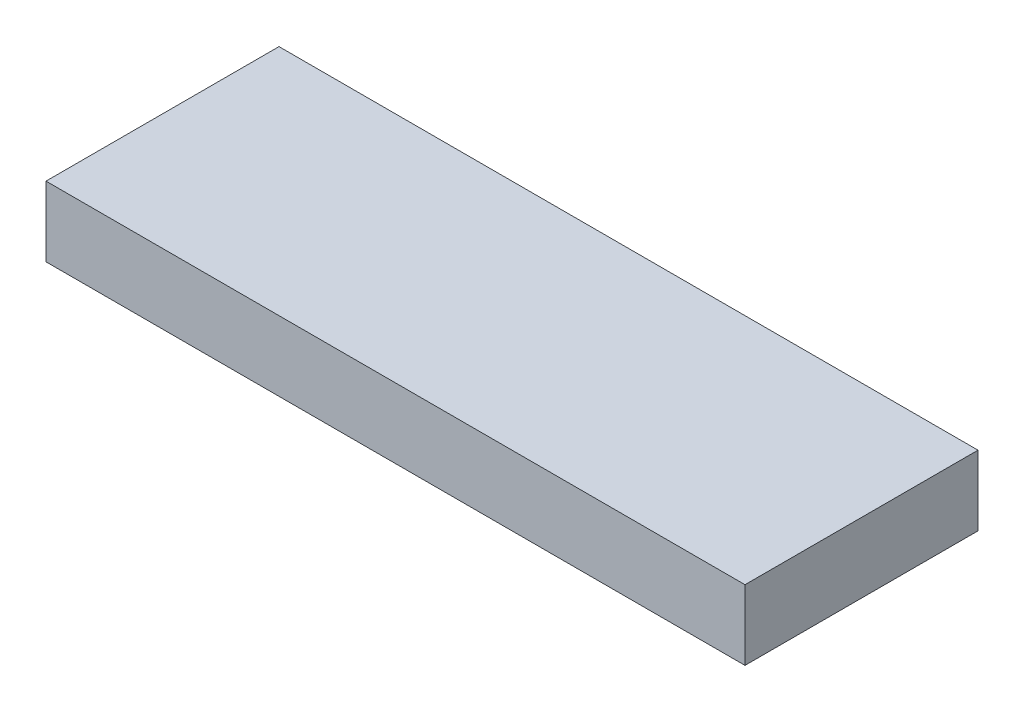
ISO-10303-21;
HEADER;
FILE_DESCRIPTION(('STEP AP214'),'2;1');
FILE_NAME('part.step','',(''),(''),'','','');
FILE_SCHEMA(('AUTOMOTIVE_DESIGN { 1 0 10303 214 1 1 1 1 }'));
ENDSEC;
DATA;
#1=APPLICATION_CONTEXT('core data for automotive mechanical design processes');
#2=APPLICATION_PROTOCOL_DEFINITION('international standard','automotive_design',2000,#1);
#3=PRODUCT_CONTEXT('',#1,'mechanical');
#4=PRODUCT('Part','Part','',(#3));
#5=PRODUCT_RELATED_PRODUCT_CATEGORY('part','',(#4));
#6=PRODUCT_DEFINITION_FORMATION('','',#4);
#7=PRODUCT_DEFINITION_CONTEXT('part definition',#1,'design');
#8=PRODUCT_DEFINITION('design','',#6,#7);
#9=PRODUCT_DEFINITION_SHAPE('','',#8);
#10=(LENGTH_UNIT() NAMED_UNIT(*) SI_UNIT(.MILLI.,.METRE.));
#11=(NAMED_UNIT(*) PLANE_ANGLE_UNIT() SI_UNIT($,.RADIAN.));
#12=(NAMED_UNIT(*) SI_UNIT($,.STERADIAN.) SOLID_ANGLE_UNIT());
#13=UNCERTAINTY_MEASURE_WITH_UNIT(LENGTH_MEASURE(1.E-05),#10,'distance_accuracy_value','');
#14=(GEOMETRIC_REPRESENTATION_CONTEXT(3) GLOBAL_UNCERTAINTY_ASSIGNED_CONTEXT((#13)) GLOBAL_UNIT_ASSIGNED_CONTEXT((#10,
#11,#12)) REPRESENTATION_CONTEXT('',''));
#15=CARTESIAN_POINT('',(0.,0.,0.));
#16=DIRECTION('',(0.,0.,1.));
#17=DIRECTION('',(1.,0.,0.));
#18=AXIS2_PLACEMENT_3D('',#15,#16,#17);
#19=CARTESIAN_POINT('',(-300.,46.99,23.));
#20=DIRECTION('',(0.,0.,1.));
#21=DIRECTION('',(1.,0.,0.));
#22=AXIS2_PLACEMENT_3D('',#19,#20,#21);
#23=PLANE('',#22);
#24=DIRECTION('',(0.,1.,0.));
#25=VECTOR('',#24,1.);
#26=CARTESIAN_POINT('',(-300.,0.,23.));
#27=LINE('',#26,#25);
#28=CARTESIAN_POINT('',(-300.,47.,23.));
#29=VERTEX_POINT('',#28);
#30=CARTESIAN_POINT('',(-300.,50.,23.));
#31=VERTEX_POINT('',#30);
#32=EDGE_CURVE('E58',#29,#31,#27,.T.);
#33=ORIENTED_EDGE('',*,*,#32,.F.);
#34=DIRECTION('',(1.,0.,0.));
#35=VECTOR('',#34,1.);
#36=CARTESIAN_POINT('',(300.,47.,22.9999999999999));
#37=LINE('',#36,#35);
#38=CARTESIAN_POINT('',(-270.,47.,23.));
#39=VERTEX_POINT('',#38);
#40=EDGE_CURVE('E88',#29,#39,#37,.T.);
#41=ORIENTED_EDGE('',*,*,#40,.T.);
#42=DIRECTION('',(0.,1.,0.));
#43=VECTOR('',#42,1.);
#44=CARTESIAN_POINT('',(-270.,46.99,23.));
#45=LINE('',#44,#43);
#46=CARTESIAN_POINT('',(-270.,50.,23.));
#47=VERTEX_POINT('',#46);
#48=EDGE_CURVE('E43',#39,#47,#45,.T.);
#49=ORIENTED_EDGE('',*,*,#48,.T.);
#50=DIRECTION('',(-1.,0.,0.));
#51=VECTOR('',#50,1.);
#52=CARTESIAN_POINT('',(-300.,50.,23.));
#53=LINE('',#52,#51);
#54=EDGE_CURVE('E103',#47,#31,#53,.T.);
#55=ORIENTED_EDGE('',*,*,#54,.T.);
#56=EDGE_LOOP('',(#33,#41,#49,#55));
#57=FACE_BOUND('',#56,.T.);
#58=ADVANCED_FACE('F35',(#57),#23,.T.);
#59=CARTESIAN_POINT('',(-300.,46.99,13.));
#60=DIRECTION('',(0.,0.,-1.));
#61=DIRECTION('',(-1.,0.,0.));
#62=AXIS2_PLACEMENT_3D('',#59,#60,#61);
#63=PLANE('',#62);
#64=DIRECTION('',(0.,1.,0.));
#65=VECTOR('',#64,1.);
#66=CARTESIAN_POINT('',(-270.,46.99,13.));
#67=LINE('',#66,#65);
#68=CARTESIAN_POINT('',(-270.,47.,13.));
#69=VERTEX_POINT('',#68);
#70=CARTESIAN_POINT('',(-270.,50.,13.));
#71=VERTEX_POINT('',#70);
#72=EDGE_CURVE('E11',#69,#71,#67,.T.);
#73=ORIENTED_EDGE('',*,*,#72,.F.);
#74=DIRECTION('',(-1.,0.,0.));
#75=VECTOR('',#74,1.);
#76=CARTESIAN_POINT('',(300.,47.,13.));
#77=LINE('',#76,#75);
#78=CARTESIAN_POINT('',(-300.,47.,13.));
#79=VERTEX_POINT('',#78);
#80=EDGE_CURVE('E89',#69,#79,#77,.T.);
#81=ORIENTED_EDGE('',*,*,#80,.T.);
#82=DIRECTION('',(0.,-1.,0.));
#83=VECTOR('',#82,1.);
#84=CARTESIAN_POINT('',(-300.,0.,13.));
#85=LINE('',#84,#83);
#86=CARTESIAN_POINT('',(-300.,50.,13.));
#87=VERTEX_POINT('',#86);
#88=EDGE_CURVE('E50',#87,#79,#85,.T.);
#89=ORIENTED_EDGE('',*,*,#88,.F.);
#90=DIRECTION('',(1.,0.,0.));
#91=VECTOR('',#90,1.);
#92=CARTESIAN_POINT('',(-300.,50.,13.));
#93=LINE('',#92,#91);
#94=EDGE_CURVE('E99',#87,#71,#93,.T.);
#95=ORIENTED_EDGE('',*,*,#94,.T.);
#96=EDGE_LOOP('',(#73,#81,#89,#95));
#97=FACE_BOUND('',#96,.T.);
#98=ADVANCED_FACE('F105',(#97),#63,.T.);
#99=CARTESIAN_POINT('',(-270.,46.99,13.));
#100=DIRECTION('',(1.,0.,0.));
#101=DIRECTION('',(0.,0.,-1.));
#102=AXIS2_PLACEMENT_3D('',#99,#100,#101);
#103=PLANE('',#102);
#104=ORIENTED_EDGE('',*,*,#48,.F.);
#105=DIRECTION('',(0.,0.,-1.));
#106=VECTOR('',#105,1.);
#107=CARTESIAN_POINT('',(-270.,47.,3.));
#108=LINE('',#107,#106);
#109=EDGE_CURVE('E79',#39,#69,#108,.T.);
#110=ORIENTED_EDGE('',*,*,#109,.T.);
#111=ORIENTED_EDGE('',*,*,#72,.T.);
#112=DIRECTION('',(0.,0.,1.));
#113=VECTOR('',#112,1.);
#114=CARTESIAN_POINT('',(-270.,50.,60.));
#115=LINE('',#114,#113);
#116=EDGE_CURVE('E81',#71,#47,#115,.T.);
#117=ORIENTED_EDGE('',*,*,#116,.T.);
#118=EDGE_LOOP('',(#104,#110,#111,#117));
#119=FACE_BOUND('',#118,.T.);
#120=ADVANCED_FACE('F78',(#119),#103,.T.);
#121=CARTESIAN_POINT('',(-300.,0.,0.));
#122=DIRECTION('',(-1.,0.,0.));
#123=DIRECTION('',(0.,0.,1.));
#124=AXIS2_PLACEMENT_3D('',#121,#122,#123);
#125=PLANE('',#124);
#126=DIRECTION('',(0.,0.,1.));
#127=VECTOR('',#126,1.);
#128=CARTESIAN_POINT('',(-300.,47.,3.));
#129=LINE('',#128,#127);
#130=EDGE_CURVE('E95',#79,#29,#129,.T.);
#131=ORIENTED_EDGE('',*,*,#130,.T.);
#132=ORIENTED_EDGE('',*,*,#32,.T.);
#133=DIRECTION('',(0.,0.,-1.));
#134=VECTOR('',#133,1.);
#135=CARTESIAN_POINT('',(-300.,50.,60.));
#136=LINE('',#135,#134);
#137=EDGE_CURVE('E83',#31,#87,#136,.T.);
#138=ORIENTED_EDGE('',*,*,#137,.T.);
#139=ORIENTED_EDGE('',*,*,#88,.T.);
#140=EDGE_LOOP('',(#131,#132,#138,#139));
#141=FACE_BOUND('',#140,.T.);
#142=ADVANCED_FACE('F37',(#141),#125,.T.);
#143=CARTESIAN_POINT('',(-300.,50.,60.));
#144=DIRECTION('',(0.,-1.,0.));
#145=DIRECTION('',(0.,0.,-1.));
#146=AXIS2_PLACEMENT_3D('',#143,#144,#145);
#147=PLANE('',#146);
#148=ORIENTED_EDGE('',*,*,#54,.F.);
#149=ORIENTED_EDGE('',*,*,#116,.F.);
#150=ORIENTED_EDGE('',*,*,#94,.F.);
#151=ORIENTED_EDGE('',*,*,#137,.F.);
#152=EDGE_LOOP('',(#148,#149,#150,#151));
#153=FACE_BOUND('',#152,.T.);
#154=ADVANCED_FACE('F109',(#153),#147,.F.);
#155=CARTESIAN_POINT('',(300.,47.,3.));
#156=DIRECTION('',(0.,1.,0.));
#157=DIRECTION('',(0.,0.,1.));
#158=AXIS2_PLACEMENT_3D('',#155,#156,#157);
#159=PLANE('',#158);
#160=ORIENTED_EDGE('',*,*,#40,.F.);
#161=ORIENTED_EDGE('',*,*,#130,.F.);
#162=ORIENTED_EDGE('',*,*,#80,.F.);
#163=ORIENTED_EDGE('',*,*,#109,.F.);
#164=EDGE_LOOP('',(#160,#161,#162,#163));
#165=FACE_BOUND('',#164,.T.);
#166=ADVANCED_FACE('F86',(#165),#159,.F.);
#167=CLOSED_SHELL('',(#58,#98,#120,#142,#154,#166));
#168=MANIFOLD_SOLID_BREP('B2',#167);
#169=ADVANCED_BREP_SHAPE_REPRESENTATION('',(#18,#168),#14);
#170=SHAPE_DEFINITION_REPRESENTATION(#9,#169);
ENDSEC;
END-ISO-10303-21;
